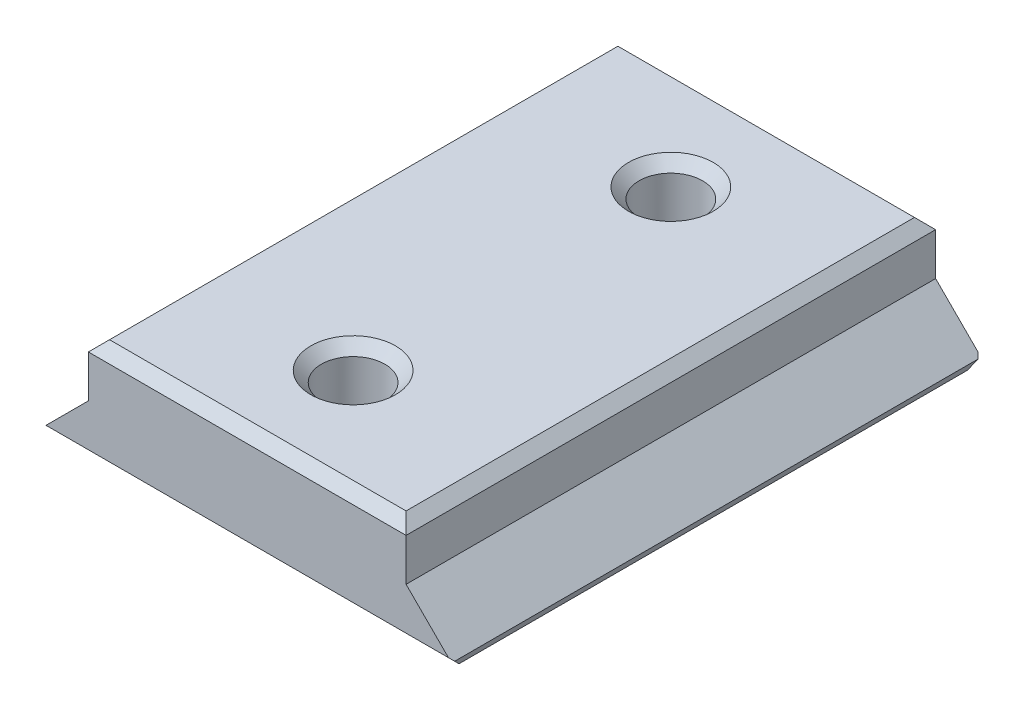
ISO-10303-21;
HEADER;
FILE_DESCRIPTION(('STEP AP214'),'2;1');
FILE_NAME('part.step','',(''),(''),'','','');
FILE_SCHEMA(('AUTOMOTIVE_DESIGN { 1 0 10303 214 1 1 1 1 }'));
ENDSEC;
DATA;
#1=APPLICATION_CONTEXT('core data for automotive mechanical design processes');
#2=APPLICATION_PROTOCOL_DEFINITION('international standard','automotive_design',2000,#1);
#3=PRODUCT_CONTEXT('',#1,'mechanical');
#4=PRODUCT('Part','Part','',(#3));
#5=PRODUCT_RELATED_PRODUCT_CATEGORY('part','',(#4));
#6=PRODUCT_DEFINITION_FORMATION('','',#4);
#7=PRODUCT_DEFINITION_CONTEXT('part definition',#1,'design');
#8=PRODUCT_DEFINITION('design','',#6,#7);
#9=PRODUCT_DEFINITION_SHAPE('','',#8);
#10=(LENGTH_UNIT() NAMED_UNIT(*) SI_UNIT(.MILLI.,.METRE.));
#11=(NAMED_UNIT(*) PLANE_ANGLE_UNIT() SI_UNIT($,.RADIAN.));
#12=(NAMED_UNIT(*) SI_UNIT($,.STERADIAN.) SOLID_ANGLE_UNIT());
#13=UNCERTAINTY_MEASURE_WITH_UNIT(LENGTH_MEASURE(1.E-05),#10,'distance_accuracy_value','');
#14=(GEOMETRIC_REPRESENTATION_CONTEXT(3) GLOBAL_UNCERTAINTY_ASSIGNED_CONTEXT((#13)) GLOBAL_UNIT_ASSIGNED_CONTEXT((#10,
#11,#12)) REPRESENTATION_CONTEXT('',''));
#15=CARTESIAN_POINT('',(0.,0.,0.));
#16=DIRECTION('',(0.,0.,1.));
#17=DIRECTION('',(1.,0.,0.));
#18=AXIS2_PLACEMENT_3D('',#15,#16,#17);
#19=CARTESIAN_POINT('',(-15.,-5.,50.));
#20=DIRECTION('',(1.,0.,0.));
#21=DIRECTION('',(0.,0.,-1.));
#22=AXIS2_PLACEMENT_3D('',#19,#20,#21);
#23=PLANE('',#22);
#24=DIRECTION('',(0.,-1.,0.));
#25=VECTOR('',#24,1.);
#26=CARTESIAN_POINT('',(-15.,-5.,50.));
#27=LINE('',#26,#25);
#28=CARTESIAN_POINT('',(-15.,-1.00000000000001,50.));
#29=VERTEX_POINT('',#28);
#30=CARTESIAN_POINT('',(-15.,-5.,50.));
#31=VERTEX_POINT('',#30);
#32=EDGE_CURVE('E137',#29,#31,#27,.T.);
#33=ORIENTED_EDGE('',*,*,#32,.F.);
#34=DIRECTION('',(0.,0.,-1.));
#35=VECTOR('',#34,1.);
#36=CARTESIAN_POINT('',(-15.,-1.00000000000001,50.));
#37=LINE('',#36,#35);
#38=CARTESIAN_POINT('',(-15.,-1.00000000000001,0.));
#39=VERTEX_POINT('',#38);
#40=EDGE_CURVE('E210',#29,#39,#37,.T.);
#41=ORIENTED_EDGE('',*,*,#40,.T.);
#42=DIRECTION('',(0.,-1.,0.));
#43=VECTOR('',#42,1.);
#44=CARTESIAN_POINT('',(-15.,-5.,0.));
#45=LINE('',#44,#43);
#46=CARTESIAN_POINT('',(-15.,-5.,0.));
#47=VERTEX_POINT('',#46);
#48=EDGE_CURVE('E152',#39,#47,#45,.T.);
#49=ORIENTED_EDGE('',*,*,#48,.T.);
#50=DIRECTION('',(0.,0.,-1.));
#51=VECTOR('',#50,1.);
#52=CARTESIAN_POINT('',(-15.,-5.,50.));
#53=LINE('',#52,#51);
#54=EDGE_CURVE('E150',#31,#47,#53,.T.);
#55=ORIENTED_EDGE('',*,*,#54,.F.);
#56=EDGE_LOOP('',(#33,#41,#49,#55));
#57=FACE_BOUND('',#56,.T.);
#58=ADVANCED_FACE('F45',(#57),#23,.F.);
#59=CARTESIAN_POINT('',(-20.,-10.,50.));
#60=DIRECTION('',(0.707106781186548,-0.707106781186547,0.));
#61=DIRECTION('',(0.707106781186547,0.707106781186548,0.));
#62=AXIS2_PLACEMENT_3D('',#59,#60,#61);
#63=PLANE('',#62);
#64=DIRECTION('',(-0.707106781186547,-0.707106781186548,0.));
#65=VECTOR('',#64,1.);
#66=CARTESIAN_POINT('',(-20.,-10.,0.));
#67=LINE('',#66,#65);
#68=CARTESIAN_POINT('',(-19.,-9.00000000000001,0.));
#69=VERTEX_POINT('',#68);
#70=EDGE_CURVE('E166',#47,#69,#67,.T.);
#71=ORIENTED_EDGE('',*,*,#70,.T.);
#72=DIRECTION('',(-0.577350269189626,-0.577350269189628,0.577350269189624));
#73=VECTOR('',#72,1.);
#74=CARTESIAN_POINT('',(-6.66666666666664,3.33333333333338,-12.3333333333333));
#75=LINE('',#74,#73);
#76=CARTESIAN_POINT('',(-19.2928932188134,-9.29289321881345,0.292893218813442));
#77=VERTEX_POINT('',#76);
#78=EDGE_CURVE('E251',#69,#77,#75,.T.);
#79=ORIENTED_EDGE('',*,*,#78,.T.);
#80=DIRECTION('',(0.,0.,1.));
#81=VECTOR('',#80,1.);
#82=CARTESIAN_POINT('',(-19.2928932188134,-9.29289321881345,50.));
#83=LINE('',#82,#81);
#84=CARTESIAN_POINT('',(-19.2928932188134,-9.29289321881345,49.7071067811866));
#85=VERTEX_POINT('',#84);
#86=EDGE_CURVE('E233',#77,#85,#83,.T.);
#87=ORIENTED_EDGE('',*,*,#86,.T.);
#88=DIRECTION('',(-0.577350269189624,-0.577350269189625,-0.577350269189629));
#89=VECTOR('',#88,1.);
#90=CARTESIAN_POINT('',(-12.6666666666667,-2.66666666666671,56.3333333333333));
#91=LINE('',#90,#89);
#92=CARTESIAN_POINT('',(-19.,-9.00000000000001,50.));
#93=VERTEX_POINT('',#92);
#94=EDGE_CURVE('E61',#85,#93,#91,.F.);
#95=ORIENTED_EDGE('',*,*,#94,.T.);
#96=DIRECTION('',(-0.707106781186547,-0.707106781186548,0.));
#97=VECTOR('',#96,1.);
#98=CARTESIAN_POINT('',(-20.,-10.,50.));
#99=LINE('',#98,#97);
#100=EDGE_CURVE('E140',#31,#93,#99,.T.);
#101=ORIENTED_EDGE('',*,*,#100,.F.);
#102=ORIENTED_EDGE('',*,*,#54,.T.);
#103=EDGE_LOOP('',(#71,#79,#87,#95,#101,#102));
#104=FACE_BOUND('',#103,.T.);
#105=ADVANCED_FACE('F158',(#104),#63,.F.);
#106=CARTESIAN_POINT('',(20.,-10.,50.));
#107=DIRECTION('',(0.,1.,0.));
#108=DIRECTION('',(-1.,0.,0.));
#109=AXIS2_PLACEMENT_3D('',#106,#107,#108);
#110=PLANE('',#109);
#111=CARTESIAN_POINT('',(0.,-10.,40.));
#112=DIRECTION('',(0.,1.,0.));
#113=DIRECTION('',(-1.,0.,0.));
#114=AXIS2_PLACEMENT_3D('',#111,#112,#113);
#115=CIRCLE('',#114,8.);
#116=CARTESIAN_POINT('',(-8.,-10.,40.));
#117=VERTEX_POINT('',#116);
#118=EDGE_CURVE('E183',#117,#117,#115,.T.);
#119=ORIENTED_EDGE('',*,*,#118,.T.);
#120=EDGE_LOOP('',(#119));
#121=FACE_BOUND('',#120,.T.);
#122=CARTESIAN_POINT('',(0.,-10.,10.));
#123=DIRECTION('',(0.,1.,0.));
#124=DIRECTION('',(-1.,0.,0.));
#125=AXIS2_PLACEMENT_3D('',#122,#123,#124);
#126=CIRCLE('',#125,8.00000000000003);
#127=CARTESIAN_POINT('',(-8.00000000000003,-10.,10.));
#128=VERTEX_POINT('',#127);
#129=EDGE_CURVE('E177',#128,#128,#126,.T.);
#130=ORIENTED_EDGE('',*,*,#129,.T.);
#131=EDGE_LOOP('',(#130));
#132=FACE_BOUND('',#131,.T.);
#133=DIRECTION('',(0.,0.,-1.));
#134=VECTOR('',#133,1.);
#135=CARTESIAN_POINT('',(-19.,-10.,50.));
#136=LINE('',#135,#134);
#137=CARTESIAN_POINT('',(-19.,-10.,49.));
#138=VERTEX_POINT('',#137);
#139=CARTESIAN_POINT('',(-19.,-10.,0.999999999999994));
#140=VERTEX_POINT('',#139);
#141=EDGE_CURVE('E227',#138,#140,#136,.T.);
#142=ORIENTED_EDGE('',*,*,#141,.T.);
#143=DIRECTION('',(1.,0.,0.));
#144=VECTOR('',#143,1.);
#145=CARTESIAN_POINT('',(19.,-10.,0.999999999999994));
#146=LINE('',#145,#144);
#147=CARTESIAN_POINT('',(19.,-10.,0.999999999999994));
#148=VERTEX_POINT('',#147);
#149=EDGE_CURVE('E237',#140,#148,#146,.T.);
#150=ORIENTED_EDGE('',*,*,#149,.T.);
#151=DIRECTION('',(0.,0.,1.));
#152=VECTOR('',#151,1.);
#153=CARTESIAN_POINT('',(19.,-10.,50.));
#154=LINE('',#153,#152);
#155=CARTESIAN_POINT('',(19.,-10.,49.));
#156=VERTEX_POINT('',#155);
#157=EDGE_CURVE('E230',#148,#156,#154,.T.);
#158=ORIENTED_EDGE('',*,*,#157,.T.);
#159=DIRECTION('',(-1.,0.,0.));
#160=VECTOR('',#159,1.);
#161=CARTESIAN_POINT('',(20.,-10.,49.));
#162=LINE('',#161,#160);
#163=EDGE_CURVE('E235',#156,#138,#162,.T.);
#164=ORIENTED_EDGE('',*,*,#163,.T.);
#165=EDGE_LOOP('',(#142,#150,#158,#164));
#166=FACE_BOUND('',#165,.T.);
#167=ADVANCED_FACE('F259',(#121,#132,#166),#110,.F.);
#168=CARTESIAN_POINT('',(15.,-5.,50.));
#169=DIRECTION('',(-0.707106781186547,-0.707106781186548,0.));
#170=DIRECTION('',(0.707106781186548,-0.707106781186547,0.));
#171=AXIS2_PLACEMENT_3D('',#168,#169,#170);
#172=PLANE('',#171);
#173=DIRECTION('',(0.,0.,-1.));
#174=VECTOR('',#173,1.);
#175=CARTESIAN_POINT('',(19.2928932188135,-9.29289321881346,50.));
#176=LINE('',#175,#174);
#177=CARTESIAN_POINT('',(19.2928932188135,-9.29289321881346,49.7071067811865));
#178=VERTEX_POINT('',#177);
#179=CARTESIAN_POINT('',(19.2928932188135,-9.29289321881346,0.292893218813463));
#180=VERTEX_POINT('',#179);
#181=EDGE_CURVE('E215',#178,#180,#176,.T.);
#182=ORIENTED_EDGE('',*,*,#181,.T.);
#183=DIRECTION('',(-0.577350269189627,0.577350269189627,-0.577350269189623));
#184=VECTOR('',#183,1.);
#185=CARTESIAN_POINT('',(20.,-10.,0.999999999999994));
#186=LINE('',#185,#184);
#187=CARTESIAN_POINT('',(19.,-9.00000000000001,0.));
#188=VERTEX_POINT('',#187);
#189=EDGE_CURVE('E246',#180,#188,#186,.T.);
#190=ORIENTED_EDGE('',*,*,#189,.T.);
#191=DIRECTION('',(-0.707106781186548,0.707106781186547,0.));
#192=VECTOR('',#191,1.);
#193=CARTESIAN_POINT('',(15.,-5.,0.));
#194=LINE('',#193,#192);
#195=CARTESIAN_POINT('',(15.,-5.,0.));
#196=VERTEX_POINT('',#195);
#197=EDGE_CURVE('E169',#188,#196,#194,.T.);
#198=ORIENTED_EDGE('',*,*,#197,.T.);
#199=DIRECTION('',(0.,0.,-1.));
#200=VECTOR('',#199,1.);
#201=CARTESIAN_POINT('',(15.,-5.,50.));
#202=LINE('',#201,#200);
#203=CARTESIAN_POINT('',(15.,-5.,50.));
#204=VERTEX_POINT('',#203);
#205=EDGE_CURVE('E156',#204,#196,#202,.T.);
#206=ORIENTED_EDGE('',*,*,#205,.F.);
#207=DIRECTION('',(-0.707106781186548,0.707106781186547,0.));
#208=VECTOR('',#207,1.);
#209=CARTESIAN_POINT('',(15.,-5.,50.));
#210=LINE('',#209,#208);
#211=CARTESIAN_POINT('',(19.,-9.00000000000001,50.));
#212=VERTEX_POINT('',#211);
#213=EDGE_CURVE('E159',#212,#204,#210,.T.);
#214=ORIENTED_EDGE('',*,*,#213,.F.);
#215=DIRECTION('',(-0.577350269189625,0.577350269189624,0.577350269189628));
#216=VECTOR('',#215,1.);
#217=CARTESIAN_POINT('',(12.6666666666667,-2.6666666666667,56.3333333333333));
#218=LINE('',#217,#216);
#219=EDGE_CURVE('E244',#212,#178,#218,.F.);
#220=ORIENTED_EDGE('',*,*,#219,.T.);
#221=EDGE_LOOP('',(#182,#190,#198,#206,#214,#220));
#222=FACE_BOUND('',#221,.T.);
#223=ADVANCED_FACE('F270',(#222),#172,.F.);
#224=CARTESIAN_POINT('',(15.,0.,50.));
#225=DIRECTION('',(-1.,0.,0.));
#226=DIRECTION('',(0.,0.,1.));
#227=AXIS2_PLACEMENT_3D('',#224,#225,#226);
#228=PLANE('',#227);
#229=DIRECTION('',(0.,1.,0.));
#230=VECTOR('',#229,1.);
#231=CARTESIAN_POINT('',(15.,0.,0.));
#232=LINE('',#231,#230);
#233=CARTESIAN_POINT('',(15.,-1.00000000000001,0.));
#234=VERTEX_POINT('',#233);
#235=EDGE_CURVE('E147',#196,#234,#232,.T.);
#236=ORIENTED_EDGE('',*,*,#235,.T.);
#237=DIRECTION('',(0.,0.,1.));
#238=VECTOR('',#237,1.);
#239=CARTESIAN_POINT('',(15.,-1.00000000000001,50.));
#240=LINE('',#239,#238);
#241=CARTESIAN_POINT('',(15.,-1.00000000000001,50.));
#242=VERTEX_POINT('',#241);
#243=EDGE_CURVE('E212',#234,#242,#240,.T.);
#244=ORIENTED_EDGE('',*,*,#243,.T.);
#245=DIRECTION('',(0.,1.,0.));
#246=VECTOR('',#245,1.);
#247=CARTESIAN_POINT('',(15.,0.,50.));
#248=LINE('',#247,#246);
#249=EDGE_CURVE('E161',#204,#242,#248,.T.);
#250=ORIENTED_EDGE('',*,*,#249,.F.);
#251=ORIENTED_EDGE('',*,*,#205,.T.);
#252=EDGE_LOOP('',(#236,#244,#250,#251));
#253=FACE_BOUND('',#252,.T.);
#254=ADVANCED_FACE('F278',(#253),#228,.F.);
#255=CARTESIAN_POINT('',(0.,0.,50.));
#256=DIRECTION('',(0.,-1.,0.));
#257=DIRECTION('',(0.,0.,-1.));
#258=AXIS2_PLACEMENT_3D('',#255,#256,#257);
#259=PLANE('',#258);
#260=CARTESIAN_POINT('',(0.,0.,40.));
#261=DIRECTION('',(0.,-1.,0.));
#262=DIRECTION('',(0.,0.,-1.));
#263=AXIS2_PLACEMENT_3D('',#260,#261,#262);
#264=CIRCLE('',#263,4.);
#265=CARTESIAN_POINT('',(0.,0.,36.));
#266=VERTEX_POINT('',#265);
#267=EDGE_CURVE('E198',#266,#266,#264,.T.);
#268=ORIENTED_EDGE('',*,*,#267,.T.);
#269=EDGE_LOOP('',(#268));
#270=FACE_BOUND('',#269,.T.);
#271=CARTESIAN_POINT('',(0.,0.,10.));
#272=DIRECTION('',(0.,-1.,0.));
#273=DIRECTION('',(0.,0.,-1.));
#274=AXIS2_PLACEMENT_3D('',#271,#272,#273);
#275=CIRCLE('',#274,4.);
#276=CARTESIAN_POINT('',(0.,0.,6.));
#277=VERTEX_POINT('',#276);
#278=EDGE_CURVE('E195',#277,#277,#275,.T.);
#279=ORIENTED_EDGE('',*,*,#278,.T.);
#280=EDGE_LOOP('',(#279));
#281=FACE_BOUND('',#280,.T.);
#282=DIRECTION('',(0.,0.,-1.));
#283=VECTOR('',#282,1.);
#284=CARTESIAN_POINT('',(14.,0.,50.));
#285=LINE('',#284,#283);
#286=CARTESIAN_POINT('',(14.,0.,49.));
#287=VERTEX_POINT('',#286);
#288=CARTESIAN_POINT('',(14.,0.,1.00000000000002));
#289=VERTEX_POINT('',#288);
#290=EDGE_CURVE('E188',#287,#289,#285,.T.);
#291=ORIENTED_EDGE('',*,*,#290,.T.);
#292=DIRECTION('',(-1.,0.,0.));
#293=VECTOR('',#292,1.);
#294=CARTESIAN_POINT('',(-15.,0.,1.00000000000002));
#295=LINE('',#294,#293);
#296=CARTESIAN_POINT('',(-14.,0.,1.00000000000002));
#297=VERTEX_POINT('',#296);
#298=EDGE_CURVE('E192',#289,#297,#295,.T.);
#299=ORIENTED_EDGE('',*,*,#298,.T.);
#300=DIRECTION('',(0.,0.,1.));
#301=VECTOR('',#300,1.);
#302=CARTESIAN_POINT('',(-14.,0.,50.));
#303=LINE('',#302,#301);
#304=CARTESIAN_POINT('',(-14.,0.,49.));
#305=VERTEX_POINT('',#304);
#306=EDGE_CURVE('E190',#297,#305,#303,.T.);
#307=ORIENTED_EDGE('',*,*,#306,.T.);
#308=DIRECTION('',(1.,0.,0.));
#309=VECTOR('',#308,1.);
#310=CARTESIAN_POINT('',(0.,0.,49.));
#311=LINE('',#310,#309);
#312=EDGE_CURVE('E186',#305,#287,#311,.T.);
#313=ORIENTED_EDGE('',*,*,#312,.T.);
#314=EDGE_LOOP('',(#291,#299,#307,#313));
#315=FACE_BOUND('',#314,.T.);
#316=ADVANCED_FACE('F298',(#270,#281,#315),#259,.F.);
#317=CARTESIAN_POINT('',(0.,0.,50.));
#318=DIRECTION('',(0.,0.,-1.));
#319=DIRECTION('',(-1.,0.,0.));
#320=AXIS2_PLACEMENT_3D('',#317,#318,#319);
#321=PLANE('',#320);
#322=ORIENTED_EDGE('',*,*,#100,.T.);
#323=DIRECTION('',(1.,0.,0.));
#324=VECTOR('',#323,1.);
#325=CARTESIAN_POINT('',(0.,-9.00000000000001,50.));
#326=LINE('',#325,#324);
#327=EDGE_CURVE('E11',#93,#212,#326,.T.);
#328=ORIENTED_EDGE('',*,*,#327,.T.);
#329=ORIENTED_EDGE('',*,*,#213,.T.);
#330=ORIENTED_EDGE('',*,*,#249,.T.);
#331=DIRECTION('',(-1.,0.,0.));
#332=VECTOR('',#331,1.);
#333=CARTESIAN_POINT('',(0.,-1.00000000000001,50.));
#334=LINE('',#333,#332);
#335=EDGE_CURVE('E144',#242,#29,#334,.T.);
#336=ORIENTED_EDGE('',*,*,#335,.T.);
#337=ORIENTED_EDGE('',*,*,#32,.T.);
#338=EDGE_LOOP('',(#322,#328,#329,#330,#336,#337));
#339=FACE_BOUND('',#338,.T.);
#340=ADVANCED_FACE('F139',(#339),#321,.F.);
#341=CARTESIAN_POINT('',(0.,0.,0.));
#342=DIRECTION('',(0.,0.,-1.));
#343=DIRECTION('',(-1.,0.,0.));
#344=AXIS2_PLACEMENT_3D('',#341,#342,#343);
#345=PLANE('',#344);
#346=ORIENTED_EDGE('',*,*,#197,.F.);
#347=DIRECTION('',(-1.,0.,0.));
#348=VECTOR('',#347,1.);
#349=CARTESIAN_POINT('',(-19.,-9.00000000000001,0.));
#350=LINE('',#349,#348);
#351=EDGE_CURVE('E248',#188,#69,#350,.T.);
#352=ORIENTED_EDGE('',*,*,#351,.T.);
#353=ORIENTED_EDGE('',*,*,#70,.F.);
#354=ORIENTED_EDGE('',*,*,#48,.F.);
#355=DIRECTION('',(1.,0.,0.));
#356=VECTOR('',#355,1.);
#357=CARTESIAN_POINT('',(15.,-1.00000000000001,0.));
#358=LINE('',#357,#356);
#359=EDGE_CURVE('E207',#39,#234,#358,.T.);
#360=ORIENTED_EDGE('',*,*,#359,.T.);
#361=ORIENTED_EDGE('',*,*,#235,.F.);
#362=EDGE_LOOP('',(#346,#352,#353,#354,#360,#361));
#363=FACE_BOUND('',#362,.T.);
#364=ADVANCED_FACE('F288',(#363),#345,.T.);
#365=CARTESIAN_POINT('',(0.,40.,10.));
#366=DIRECTION('',(0.,-1.,0.));
#367=DIRECTION('',(1.,0.,0.));
#368=AXIS2_PLACEMENT_3D('',#365,#366,#367);
#369=CYLINDRICAL_SURFACE('',#368,3.);
#370=CARTESIAN_POINT('',(0.,-1.00000000000001,10.));
#371=DIRECTION('',(0.,-1.,0.));
#372=DIRECTION('',(1.,0.,0.));
#373=AXIS2_PLACEMENT_3D('',#370,#371,#372);
#374=CIRCLE('',#373,3.);
#375=CARTESIAN_POINT('',(3.,-1.00000000000001,10.));
#376=VERTEX_POINT('',#375);
#377=EDGE_CURVE('E204',#376,#376,#374,.F.);
#378=ORIENTED_EDGE('',*,*,#377,.T.);
#379=EDGE_LOOP('',(#378));
#380=FACE_BOUND('',#379,.T.);
#381=CARTESIAN_POINT('',(0.,-4.99999999999999,10.));
#382=DIRECTION('',(0.,1.,0.));
#383=DIRECTION('',(-1.,0.,0.));
#384=AXIS2_PLACEMENT_3D('',#381,#382,#383);
#385=CIRCLE('',#384,3.);
#386=CARTESIAN_POINT('',(-3.,-4.99999999999999,10.));
#387=VERTEX_POINT('',#386);
#388=EDGE_CURVE('E155',#387,#387,#385,.F.);
#389=ORIENTED_EDGE('',*,*,#388,.T.);
#390=EDGE_LOOP('',(#389));
#391=FACE_BOUND('',#390,.T.);
#392=ADVANCED_FACE('F407',(#380,#391),#369,.F.);
#393=CARTESIAN_POINT('',(0.,40.,40.));
#394=DIRECTION('',(0.,-1.,0.));
#395=DIRECTION('',(1.,0.,0.));
#396=AXIS2_PLACEMENT_3D('',#393,#394,#395);
#397=CYLINDRICAL_SURFACE('',#396,3.);
#398=CARTESIAN_POINT('',(0.,-1.,40.));
#399=DIRECTION('',(0.,-1.,0.));
#400=DIRECTION('',(1.,0.,0.));
#401=AXIS2_PLACEMENT_3D('',#398,#399,#400);
#402=CIRCLE('',#401,3.);
#403=CARTESIAN_POINT('',(3.,-1.,40.));
#404=VERTEX_POINT('',#403);
#405=EDGE_CURVE('E201',#404,#404,#402,.F.);
#406=ORIENTED_EDGE('',*,*,#405,.T.);
#407=EDGE_LOOP('',(#406));
#408=FACE_BOUND('',#407,.T.);
#409=CARTESIAN_POINT('',(0.,-5.00000000000002,40.));
#410=DIRECTION('',(0.,1.,0.));
#411=DIRECTION('',(-1.,0.,0.));
#412=AXIS2_PLACEMENT_3D('',#409,#410,#411);
#413=CIRCLE('',#412,3.);
#414=CARTESIAN_POINT('',(-3.,-5.00000000000002,40.));
#415=VERTEX_POINT('',#414);
#416=EDGE_CURVE('E180',#415,#415,#413,.F.);
#417=ORIENTED_EDGE('',*,*,#416,.T.);
#418=EDGE_LOOP('',(#417));
#419=FACE_BOUND('',#418,.T.);
#420=ADVANCED_FACE('F332',(#408,#419),#397,.F.);
#421=CARTESIAN_POINT('',(0.,-4.99999999999999,10.));
#422=DIRECTION('',(0.,-1.,0.));
#423=DIRECTION('',(1.,0.,0.));
#424=AXIS2_PLACEMENT_3D('',#421,#422,#423);
#425=CONICAL_SURFACE('',#424,3.,0.78539816339745);
#426=ORIENTED_EDGE('',*,*,#129,.F.);
#427=EDGE_LOOP('',(#426));
#428=FACE_BOUND('',#427,.T.);
#429=ORIENTED_EDGE('',*,*,#388,.F.);
#430=EDGE_LOOP('',(#429));
#431=FACE_BOUND('',#430,.T.);
#432=ADVANCED_FACE('F325',(#428,#431),#425,.F.);
#433=CARTESIAN_POINT('',(0.,-5.00000000000002,40.));
#434=DIRECTION('',(0.,-1.,0.));
#435=DIRECTION('',(1.,0.,0.));
#436=AXIS2_PLACEMENT_3D('',#433,#434,#435);
#437=CONICAL_SURFACE('',#436,3.,0.78539816339745);
#438=ORIENTED_EDGE('',*,*,#118,.F.);
#439=EDGE_LOOP('',(#438));
#440=FACE_BOUND('',#439,.T.);
#441=ORIENTED_EDGE('',*,*,#416,.F.);
#442=EDGE_LOOP('',(#441));
#443=FACE_BOUND('',#442,.T.);
#444=ADVANCED_FACE('F331',(#440,#443),#437,.F.);
#445=CARTESIAN_POINT('',(0.,0.,40.));
#446=DIRECTION('',(0.,1.,0.));
#447=DIRECTION('',(-1.,0.,0.));
#448=AXIS2_PLACEMENT_3D('',#445,#446,#447);
#449=CONICAL_SURFACE('',#448,4.,0.785398163397448);
#450=ORIENTED_EDGE('',*,*,#405,.F.);
#451=EDGE_LOOP('',(#450));
#452=FACE_BOUND('',#451,.T.);
#453=ORIENTED_EDGE('',*,*,#267,.F.);
#454=EDGE_LOOP('',(#453));
#455=FACE_BOUND('',#454,.T.);
#456=ADVANCED_FACE('F309',(#452,#455),#449,.F.);
#457=CARTESIAN_POINT('',(0.,0.,10.));
#458=DIRECTION('',(0.,1.,0.));
#459=DIRECTION('',(-1.,0.,0.));
#460=AXIS2_PLACEMENT_3D('',#457,#458,#459);
#461=CONICAL_SURFACE('',#460,4.,0.785398163397443);
#462=ORIENTED_EDGE('',*,*,#377,.F.);
#463=EDGE_LOOP('',(#462));
#464=FACE_BOUND('',#463,.T.);
#465=ORIENTED_EDGE('',*,*,#278,.F.);
#466=EDGE_LOOP('',(#465));
#467=FACE_BOUND('',#466,.T.);
#468=ADVANCED_FACE('F302',(#464,#467),#461,.F.);
#469=CARTESIAN_POINT('',(0.,-1.00000000000001,50.));
#470=DIRECTION('',(0.,-0.70710678118655,-0.707106781186545));
#471=DIRECTION('',(-1.,0.,0.));
#472=AXIS2_PLACEMENT_3D('',#469,#470,#471);
#473=PLANE('',#472);
#474=DIRECTION('',(-0.577350269189627,-0.577350269189623,0.577350269189627));
#475=VECTOR('',#474,1.);
#476=CARTESIAN_POINT('',(-9.99999999999998,3.99999999999997,45.));
#477=LINE('',#476,#475);
#478=EDGE_CURVE('E220',#29,#305,#477,.F.);
#479=ORIENTED_EDGE('',*,*,#478,.F.);
#480=ORIENTED_EDGE('',*,*,#335,.F.);
#481=DIRECTION('',(-0.577350269189627,0.577350269189623,-0.577350269189627));
#482=VECTOR('',#481,1.);
#483=CARTESIAN_POINT('',(9.99999999999998,3.99999999999997,45.));
#484=LINE('',#483,#482);
#485=EDGE_CURVE('E167',#287,#242,#484,.F.);
#486=ORIENTED_EDGE('',*,*,#485,.F.);
#487=ORIENTED_EDGE('',*,*,#312,.F.);
#488=EDGE_LOOP('',(#479,#480,#486,#487));
#489=FACE_BOUND('',#488,.T.);
#490=ADVANCED_FACE('F300',(#489),#473,.F.);
#491=CARTESIAN_POINT('',(14.,0.,50.));
#492=DIRECTION('',(-0.707106781186545,-0.70710678118655,0.));
#493=DIRECTION('',(0.,0.,-1.));
#494=AXIS2_PLACEMENT_3D('',#491,#492,#493);
#495=PLANE('',#494);
#496=ORIENTED_EDGE('',*,*,#485,.T.);
#497=ORIENTED_EDGE('',*,*,#243,.F.);
#498=DIRECTION('',(0.577350269189627,-0.577350269189623,-0.577350269189627));
#499=VECTOR('',#498,1.);
#500=CARTESIAN_POINT('',(-2.33333333333342,16.3333333333333,17.3333333333334));
#501=LINE('',#500,#499);
#502=EDGE_CURVE('E218',#289,#234,#501,.T.);
#503=ORIENTED_EDGE('',*,*,#502,.F.);
#504=ORIENTED_EDGE('',*,*,#290,.F.);
#505=EDGE_LOOP('',(#496,#497,#503,#504));
#506=FACE_BOUND('',#505,.T.);
#507=ADVANCED_FACE('F282',(#506),#495,.F.);
#508=CARTESIAN_POINT('',(-15.,-1.00000000000001,50.));
#509=DIRECTION('',(0.707106781186545,-0.70710678118655,0.));
#510=DIRECTION('',(0.,0.,-1.));
#511=AXIS2_PLACEMENT_3D('',#508,#509,#510);
#512=PLANE('',#511);
#513=ORIENTED_EDGE('',*,*,#478,.T.);
#514=ORIENTED_EDGE('',*,*,#306,.F.);
#515=DIRECTION('',(0.577350269189627,0.577350269189623,0.577350269189627));
#516=VECTOR('',#515,1.);
#517=CARTESIAN_POINT('',(1.66666666666675,15.6666666666666,16.6666666666667));
#518=LINE('',#517,#516);
#519=EDGE_CURVE('E216',#39,#297,#518,.T.);
#520=ORIENTED_EDGE('',*,*,#519,.F.);
#521=ORIENTED_EDGE('',*,*,#40,.F.);
#522=EDGE_LOOP('',(#513,#514,#520,#521));
#523=FACE_BOUND('',#522,.T.);
#524=ADVANCED_FACE('F295',(#523),#512,.F.);
#525=CARTESIAN_POINT('',(0.,0.,1.00000000000002));
#526=DIRECTION('',(0.,0.70710678118655,-0.707106781186545));
#527=DIRECTION('',(1.,0.,0.));
#528=AXIS2_PLACEMENT_3D('',#525,#526,#527);
#529=PLANE('',#528);
#530=ORIENTED_EDGE('',*,*,#502,.T.);
#531=ORIENTED_EDGE('',*,*,#359,.F.);
#532=ORIENTED_EDGE('',*,*,#519,.T.);
#533=ORIENTED_EDGE('',*,*,#298,.F.);
#534=EDGE_LOOP('',(#530,#531,#532,#533));
#535=FACE_BOUND('',#534,.T.);
#536=ADVANCED_FACE('F291',(#535),#529,.T.);
#537=CARTESIAN_POINT('',(19.2928932188135,-9.29289321881346,50.));
#538=DIRECTION('',(-0.923879532511286,0.382683432365091,0.));
#539=DIRECTION('',(0.,0.,-1.));
#540=AXIS2_PLACEMENT_3D('',#537,#538,#539);
#541=PLANE('',#540);
#542=ORIENTED_EDGE('',*,*,#157,.F.);
#543=DIRECTION('',(-0.281084637714822,-0.678598344545849,0.678598344545844));
#544=VECTOR('',#543,1.);
#545=CARTESIAN_POINT('',(9.81158222542177,-32.1828028081367,23.1828028081366));
#546=LINE('',#545,#544);
#547=EDGE_CURVE('E242',#148,#180,#546,.F.);
#548=ORIENTED_EDGE('',*,*,#547,.T.);
#549=ORIENTED_EDGE('',*,*,#181,.F.);
#550=DIRECTION('',(-0.28108463771482,-0.678598344545845,-0.678598344545849));
#551=VECTOR('',#550,1.);
#552=CARTESIAN_POINT('',(19.3487607169491,-9.15801714711855,49.8419828528815));
#553=LINE('',#552,#551);
#554=EDGE_CURVE('E240',#178,#156,#553,.T.);
#555=ORIENTED_EDGE('',*,*,#554,.T.);
#556=EDGE_LOOP('',(#542,#548,#549,#555));
#557=FACE_BOUND('',#556,.T.);
#558=ADVANCED_FACE('F267',(#557),#541,.F.);
#559=CARTESIAN_POINT('',(-19.,-10.,50.));
#560=DIRECTION('',(0.923879532511289,0.382683432365085,0.));
#561=DIRECTION('',(0.,0.,-1.));
#562=AXIS2_PLACEMENT_3D('',#559,#560,#561);
#563=PLANE('',#562);
#564=ORIENTED_EDGE('',*,*,#86,.F.);
#565=DIRECTION('',(-0.281084637714817,0.67859834454585,-0.678598344545845));
#566=VECTOR('',#565,1.);
#567=CARTESIAN_POINT('',(-9.65356507830336,-32.5642899477979,23.5642899477977));
#568=LINE('',#567,#566);
#569=EDGE_CURVE('E54',#77,#140,#568,.F.);
#570=ORIENTED_EDGE('',*,*,#569,.T.);
#571=ORIENTED_EDGE('',*,*,#141,.F.);
#572=DIRECTION('',(-0.281084637714815,0.678598344545846,0.67859834454585));
#573=VECTOR('',#572,1.);
#574=CARTESIAN_POINT('',(-19.1907435698305,-9.53950428677964,49.4604957132204));
#575=LINE('',#574,#573);
#576=EDGE_CURVE('E69',#138,#85,#575,.T.);
#577=ORIENTED_EDGE('',*,*,#576,.T.);
#578=EDGE_LOOP('',(#564,#570,#571,#577));
#579=FACE_BOUND('',#578,.T.);
#580=ADVANCED_FACE('F254',(#579),#563,.F.);
#581=CARTESIAN_POINT('',(20.,-10.,0.999999999999994));
#582=DIRECTION('',(0.,-0.707106781186545,-0.70710678118655));
#583=DIRECTION('',(-1.,0.,0.));
#584=AXIS2_PLACEMENT_3D('',#581,#582,#583);
#585=PLANE('',#584);
#586=ORIENTED_EDGE('',*,*,#78,.F.);
#587=ORIENTED_EDGE('',*,*,#351,.F.);
#588=ORIENTED_EDGE('',*,*,#189,.F.);
#589=ORIENTED_EDGE('',*,*,#547,.F.);
#590=ORIENTED_EDGE('',*,*,#149,.F.);
#591=ORIENTED_EDGE('',*,*,#569,.F.);
#592=EDGE_LOOP('',(#586,#587,#588,#589,#590,#591));
#593=FACE_BOUND('',#592,.T.);
#594=ADVANCED_FACE('F262',(#593),#585,.T.);
#595=CARTESIAN_POINT('',(0.,-9.00000000000001,50.));
#596=DIRECTION('',(0.,0.70710678118655,-0.707106781186545));
#597=DIRECTION('',(1.,0.,0.));
#598=AXIS2_PLACEMENT_3D('',#595,#596,#597);
#599=PLANE('',#598);
#600=ORIENTED_EDGE('',*,*,#576,.F.);
#601=ORIENTED_EDGE('',*,*,#163,.F.);
#602=ORIENTED_EDGE('',*,*,#554,.F.);
#603=ORIENTED_EDGE('',*,*,#219,.F.);
#604=ORIENTED_EDGE('',*,*,#327,.F.);
#605=ORIENTED_EDGE('',*,*,#94,.F.);
#606=EDGE_LOOP('',(#600,#601,#602,#603,#604,#605));
#607=FACE_BOUND('',#606,.T.);
#608=ADVANCED_FACE('F48',(#607),#599,.F.);
#609=CLOSED_SHELL('',(#58,#105,#167,#223,#254,#316,#340,#364,#392,#420,#432,#444,#456,#468,#490,
#507,#524,#536,#558,#580,#594,#608));
#610=MANIFOLD_SOLID_BREP('B2',#609);
#611=ADVANCED_BREP_SHAPE_REPRESENTATION('',(#18,#610),#14);
#612=SHAPE_DEFINITION_REPRESENTATION(#9,#611);
ENDSEC;
END-ISO-10303-21;
